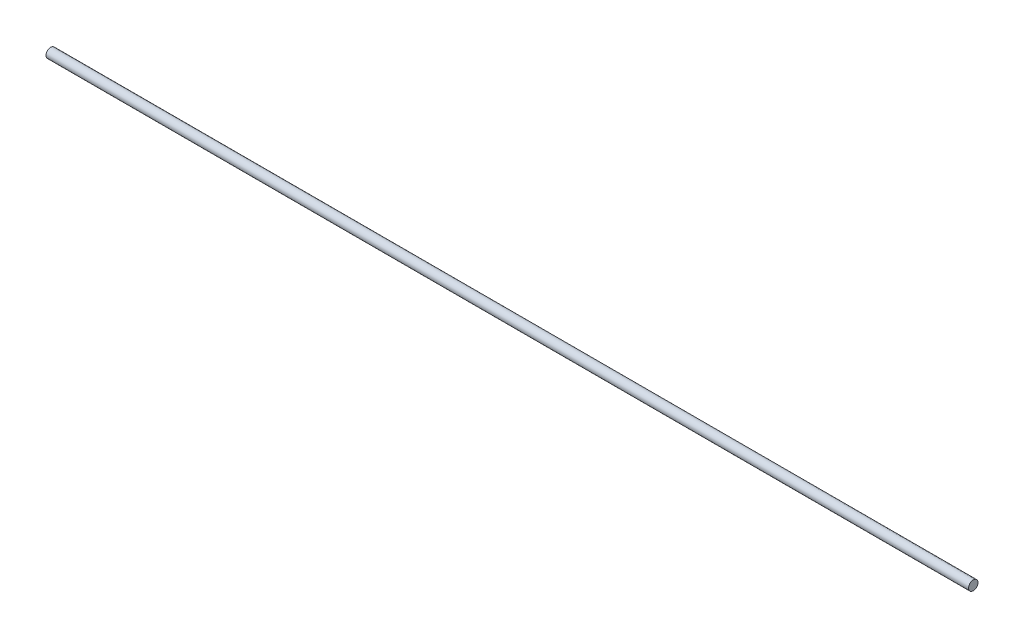
ISO-10303-21;
HEADER;
FILE_DESCRIPTION(('STEP AP214'),'2;1');
FILE_NAME('part.step','',(''),(''),'','','');
FILE_SCHEMA(('AUTOMOTIVE_DESIGN { 1 0 10303 214 1 1 1 1 }'));
ENDSEC;
DATA;
#1=APPLICATION_CONTEXT('core data for automotive mechanical design processes');
#2=APPLICATION_PROTOCOL_DEFINITION('international standard','automotive_design',2000,#1);
#3=PRODUCT_CONTEXT('',#1,'mechanical');
#4=PRODUCT('Part','Part','',(#3));
#5=PRODUCT_RELATED_PRODUCT_CATEGORY('part','',(#4));
#6=PRODUCT_DEFINITION_FORMATION('','',#4);
#7=PRODUCT_DEFINITION_CONTEXT('part definition',#1,'design');
#8=PRODUCT_DEFINITION('design','',#6,#7);
#9=PRODUCT_DEFINITION_SHAPE('','',#8);
#10=(LENGTH_UNIT() NAMED_UNIT(*) SI_UNIT(.MILLI.,.METRE.));
#11=(NAMED_UNIT(*) PLANE_ANGLE_UNIT() SI_UNIT($,.RADIAN.));
#12=(NAMED_UNIT(*) SI_UNIT($,.STERADIAN.) SOLID_ANGLE_UNIT());
#13=UNCERTAINTY_MEASURE_WITH_UNIT(LENGTH_MEASURE(1.E-05),#10,'distance_accuracy_value','');
#14=(GEOMETRIC_REPRESENTATION_CONTEXT(3) GLOBAL_UNCERTAINTY_ASSIGNED_CONTEXT((#13)) GLOBAL_UNIT_ASSIGNED_CONTEXT((#10,
#11,#12)) REPRESENTATION_CONTEXT('',''));
#15=CARTESIAN_POINT('',(0.,0.,0.));
#16=DIRECTION('',(0.,0.,1.));
#17=DIRECTION('',(1.,0.,0.));
#18=AXIS2_PLACEMENT_3D('',#15,#16,#17);
#19=CARTESIAN_POINT('',(388.923206007033,2.4696844118921,-0.892489058571755));
#20=DIRECTION('',(-1.,0.,0.));
#21=DIRECTION('',(0.,0.,1.));
#22=AXIS2_PLACEMENT_3D('',#19,#20,#21);
#23=CYLINDRICAL_SURFACE('',#22,4.);
#24=CARTESIAN_POINT('',(388.923206007033,2.4696844118921,-0.892489058571755));
#25=DIRECTION('',(1.,0.,0.));
#26=DIRECTION('',(0.,0.,-1.));
#27=AXIS2_PLACEMENT_3D('',#24,#25,#26);
#28=CIRCLE('',#27,4.);
#29=CARTESIAN_POINT('',(388.923206007033,2.4696844118921,-4.89248905857175));
#30=VERTEX_POINT('',#29);
#31=EDGE_CURVE('E9',#30,#30,#28,.T.);
#32=ORIENTED_EDGE('',*,*,#31,.F.);
#33=EDGE_LOOP('',(#32));
#34=FACE_BOUND('',#33,.T.);
#35=CARTESIAN_POINT('',(-392.076793992967,2.4696844118921,-0.892489058571755));
#36=DIRECTION('',(1.,0.,0.));
#37=DIRECTION('',(0.,0.,-1.));
#38=AXIS2_PLACEMENT_3D('',#35,#36,#37);
#39=CIRCLE('',#38,4.);
#40=CARTESIAN_POINT('',(-392.076793992967,2.4696844118921,-4.89248905857175));
#41=VERTEX_POINT('',#40);
#42=EDGE_CURVE('E17',#41,#41,#39,.T.);
#43=ORIENTED_EDGE('',*,*,#42,.T.);
#44=EDGE_LOOP('',(#43));
#45=FACE_BOUND('',#44,.T.);
#46=ADVANCED_FACE('F14',(#34,#45),#23,.T.);
#47=CARTESIAN_POINT('',(388.923206007033,2.4696844118921,-0.892489058571755));
#48=DIRECTION('',(1.,0.,0.));
#49=DIRECTION('',(0.,0.,-1.));
#50=AXIS2_PLACEMENT_3D('',#47,#48,#49);
#51=PLANE('',#50);
#52=ORIENTED_EDGE('',*,*,#31,.T.);
#53=EDGE_LOOP('',(#52));
#54=FACE_BOUND('',#53,.T.);
#55=ADVANCED_FACE('F29',(#54),#51,.T.);
#56=CARTESIAN_POINT('',(-392.076793992967,2.4696844118921,-0.892489058571755));
#57=DIRECTION('',(1.,0.,0.));
#58=DIRECTION('',(0.,0.,-1.));
#59=AXIS2_PLACEMENT_3D('',#56,#57,#58);
#60=PLANE('',#59);
#61=ORIENTED_EDGE('',*,*,#42,.F.);
#62=EDGE_LOOP('',(#61));
#63=FACE_BOUND('',#62,.T.);
#64=ADVANCED_FACE('F27',(#63),#60,.F.);
#65=CLOSED_SHELL('',(#46,#55,#64));
#66=MANIFOLD_SOLID_BREP('B1',#65);
#67=ADVANCED_BREP_SHAPE_REPRESENTATION('',(#18,#66),#14);
#68=SHAPE_DEFINITION_REPRESENTATION(#9,#67);
ENDSEC;
END-ISO-10303-21;
